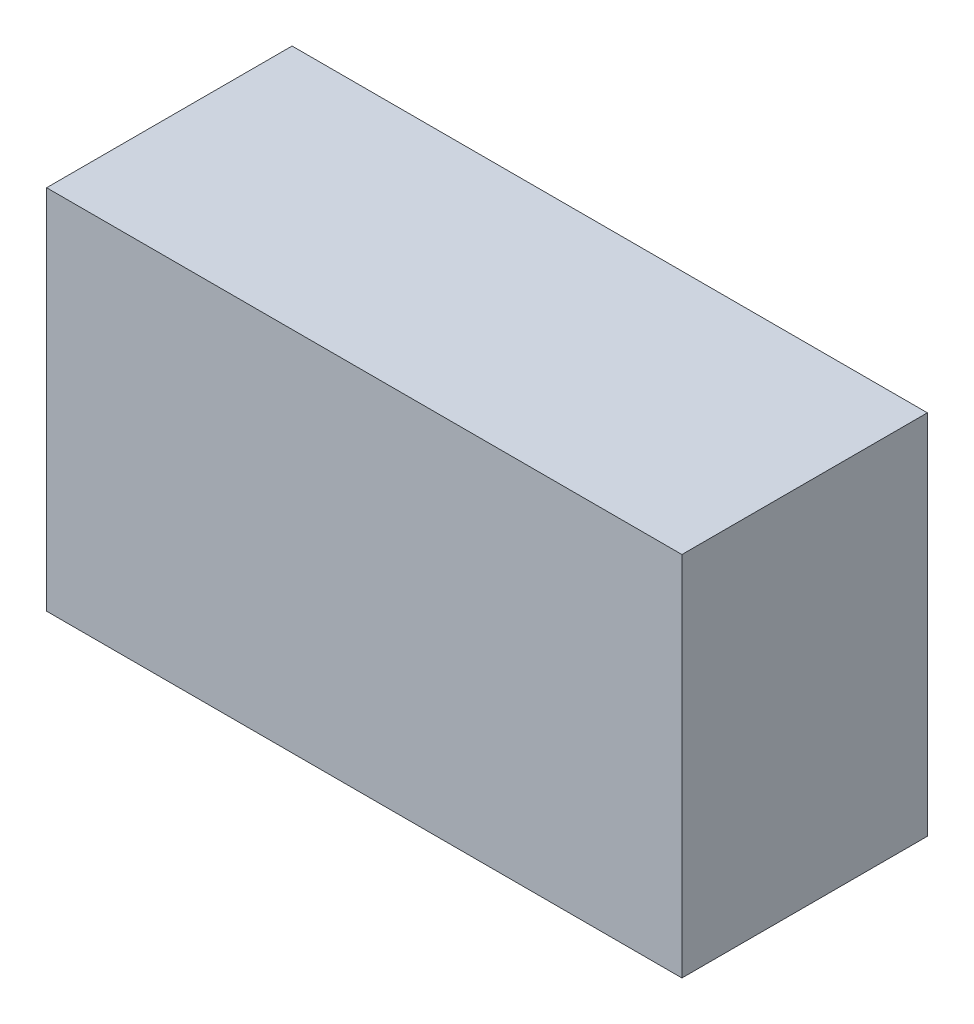
ISO-10303-21;
HEADER;
FILE_DESCRIPTION(('STEP AP214'),'2;1');
FILE_NAME('part.step','',(''),(''),'','','');
FILE_SCHEMA(('AUTOMOTIVE_DESIGN { 1 0 10303 214 1 1 1 1 }'));
ENDSEC;
DATA;
#1=APPLICATION_CONTEXT('core data for automotive mechanical design processes');
#2=APPLICATION_PROTOCOL_DEFINITION('international standard','automotive_design',2000,#1);
#3=PRODUCT_CONTEXT('',#1,'mechanical');
#4=PRODUCT('Part','Part','',(#3));
#5=PRODUCT_RELATED_PRODUCT_CATEGORY('part','',(#4));
#6=PRODUCT_DEFINITION_FORMATION('','',#4);
#7=PRODUCT_DEFINITION_CONTEXT('part definition',#1,'design');
#8=PRODUCT_DEFINITION('design','',#6,#7);
#9=PRODUCT_DEFINITION_SHAPE('','',#8);
#10=(LENGTH_UNIT() NAMED_UNIT(*) SI_UNIT(.MILLI.,.METRE.));
#11=(NAMED_UNIT(*) PLANE_ANGLE_UNIT() SI_UNIT($,.RADIAN.));
#12=(NAMED_UNIT(*) SI_UNIT($,.STERADIAN.) SOLID_ANGLE_UNIT());
#13=UNCERTAINTY_MEASURE_WITH_UNIT(LENGTH_MEASURE(1.E-05),#10,'distance_accuracy_value','');
#14=(GEOMETRIC_REPRESENTATION_CONTEXT(3) GLOBAL_UNCERTAINTY_ASSIGNED_CONTEXT((#13)) GLOBAL_UNIT_ASSIGNED_CONTEXT((#10,
#11,#12)) REPRESENTATION_CONTEXT('',''));
#15=CARTESIAN_POINT('',(0.,0.,0.));
#16=DIRECTION('',(0.,0.,1.));
#17=DIRECTION('',(1.,0.,0.));
#18=AXIS2_PLACEMENT_3D('',#15,#16,#17);
#19=CARTESIAN_POINT('',(-1.10000034,0.635,0.85000084));
#20=DIRECTION('',(0.,0.,-1.));
#21=DIRECTION('',(-1.,0.,0.));
#22=AXIS2_PLACEMENT_3D('',#19,#20,#21);
#23=PLANE('',#22);
#24=DIRECTION('',(1.,0.,0.));
#25=VECTOR('',#24,1.);
#26=CARTESIAN_POINT('',(-1.10000034,-0.635,0.85000084));
#27=LINE('',#26,#25);
#28=CARTESIAN_POINT('',(-1.10000034,-0.635,0.85000084));
#29=VERTEX_POINT('',#28);
#30=CARTESIAN_POINT('',(1.10000034,-0.635,0.85000084));
#31=VERTEX_POINT('',#30);
#32=EDGE_CURVE('E55',#29,#31,#27,.T.);
#33=ORIENTED_EDGE('',*,*,#32,.T.);
#34=DIRECTION('',(0.,1.,0.));
#35=VECTOR('',#34,1.);
#36=CARTESIAN_POINT('',(1.10000034,-0.635,0.85000084));
#37=LINE('',#36,#35);
#38=CARTESIAN_POINT('',(1.10000034,0.635,0.85000084));
#39=VERTEX_POINT('',#38);
#40=EDGE_CURVE('E58',#31,#39,#37,.T.);
#41=ORIENTED_EDGE('',*,*,#40,.T.);
#42=DIRECTION('',(1.,0.,0.));
#43=VECTOR('',#42,1.);
#44=CARTESIAN_POINT('',(1.10000034,0.635,0.85000084));
#45=LINE('',#44,#43);
#46=CARTESIAN_POINT('',(-1.10000034,0.635,0.85000084));
#47=VERTEX_POINT('',#46);
#48=EDGE_CURVE('E60',#39,#47,#45,.F.);
#49=ORIENTED_EDGE('',*,*,#48,.T.);
#50=DIRECTION('',(0.,1.,0.));
#51=VECTOR('',#50,1.);
#52=CARTESIAN_POINT('',(-1.10000034,0.635,0.85000084));
#53=LINE('',#52,#51);
#54=EDGE_CURVE('E20',#29,#47,#53,.T.);
#55=ORIENTED_EDGE('',*,*,#54,.F.);
#56=EDGE_LOOP('',(#33,#41,#49,#55));
#57=FACE_BOUND('',#56,.T.);
#58=ADVANCED_FACE('F17',(#57),#23,.F.);
#59=CARTESIAN_POINT('',(1.10000034,0.635,0.));
#60=DIRECTION('',(0.,-1.,0.));
#61=DIRECTION('',(0.,0.,-1.));
#62=AXIS2_PLACEMENT_3D('',#59,#60,#61);
#63=PLANE('',#62);
#64=DIRECTION('',(0.,0.,-1.));
#65=VECTOR('',#64,1.);
#66=CARTESIAN_POINT('',(-1.10000034,0.635,0.));
#67=LINE('',#66,#65);
#68=CARTESIAN_POINT('',(-1.10000034,0.635,0.));
#69=VERTEX_POINT('',#68);
#70=EDGE_CURVE('E71',#69,#47,#67,.F.);
#71=ORIENTED_EDGE('',*,*,#70,.T.);
#72=ORIENTED_EDGE('',*,*,#48,.F.);
#73=DIRECTION('',(0.,0.,1.));
#74=VECTOR('',#73,1.);
#75=CARTESIAN_POINT('',(1.10000034,0.635,0.));
#76=LINE('',#75,#74);
#77=CARTESIAN_POINT('',(1.10000034,0.635,0.));
#78=VERTEX_POINT('',#77);
#79=EDGE_CURVE('E65',#39,#78,#76,.F.);
#80=ORIENTED_EDGE('',*,*,#79,.T.);
#81=DIRECTION('',(-1.,0.,0.));
#82=VECTOR('',#81,1.);
#83=CARTESIAN_POINT('',(-1.10000034,0.635,0.));
#84=LINE('',#83,#82);
#85=EDGE_CURVE('E83',#69,#78,#84,.F.);
#86=ORIENTED_EDGE('',*,*,#85,.F.);
#87=EDGE_LOOP('',(#71,#72,#80,#86));
#88=FACE_BOUND('',#87,.T.);
#89=ADVANCED_FACE('F68',(#88),#63,.F.);
#90=CARTESIAN_POINT('',(1.10000034,-0.635,0.));
#91=DIRECTION('',(-1.,0.,0.));
#92=DIRECTION('',(0.,0.,1.));
#93=AXIS2_PLACEMENT_3D('',#90,#91,#92);
#94=PLANE('',#93);
#95=ORIENTED_EDGE('',*,*,#79,.F.);
#96=ORIENTED_EDGE('',*,*,#40,.F.);
#97=DIRECTION('',(0.,0.,1.));
#98=VECTOR('',#97,1.);
#99=CARTESIAN_POINT('',(1.10000034,-0.635,0.));
#100=LINE('',#99,#98);
#101=CARTESIAN_POINT('',(1.10000034,-0.635,0.));
#102=VERTEX_POINT('',#101);
#103=EDGE_CURVE('E77',#31,#102,#100,.F.);
#104=ORIENTED_EDGE('',*,*,#103,.T.);
#105=DIRECTION('',(0.,1.,0.));
#106=VECTOR('',#105,1.);
#107=CARTESIAN_POINT('',(1.10000034,0.635,0.));
#108=LINE('',#107,#106);
#109=EDGE_CURVE('E74',#78,#102,#108,.F.);
#110=ORIENTED_EDGE('',*,*,#109,.F.);
#111=EDGE_LOOP('',(#95,#96,#104,#110));
#112=FACE_BOUND('',#111,.T.);
#113=ADVANCED_FACE('F72',(#112),#94,.F.);
#114=CARTESIAN_POINT('',(-1.10000034,-0.635,0.));
#115=DIRECTION('',(0.,1.,0.));
#116=DIRECTION('',(0.,0.,1.));
#117=AXIS2_PLACEMENT_3D('',#114,#115,#116);
#118=PLANE('',#117);
#119=ORIENTED_EDGE('',*,*,#103,.F.);
#120=ORIENTED_EDGE('',*,*,#32,.F.);
#121=DIRECTION('',(0.,0.,-1.));
#122=VECTOR('',#121,1.);
#123=CARTESIAN_POINT('',(-1.10000034,-0.635,0.));
#124=LINE('',#123,#122);
#125=CARTESIAN_POINT('',(-1.10000034,-0.635,0.));
#126=VERTEX_POINT('',#125);
#127=EDGE_CURVE('E35',#29,#126,#124,.T.);
#128=ORIENTED_EDGE('',*,*,#127,.T.);
#129=DIRECTION('',(-1.,0.,0.));
#130=VECTOR('',#129,1.);
#131=CARTESIAN_POINT('',(-1.10000034,-0.635,0.));
#132=LINE('',#131,#130);
#133=EDGE_CURVE('E26',#102,#126,#132,.T.);
#134=ORIENTED_EDGE('',*,*,#133,.F.);
#135=EDGE_LOOP('',(#119,#120,#128,#134));
#136=FACE_BOUND('',#135,.T.);
#137=ADVANCED_FACE('F89',(#136),#118,.F.);
#138=CARTESIAN_POINT('',(-1.10000034,0.635,0.));
#139=DIRECTION('',(1.,0.,0.));
#140=DIRECTION('',(0.,0.,-1.));
#141=AXIS2_PLACEMENT_3D('',#138,#139,#140);
#142=PLANE('',#141);
#143=ORIENTED_EDGE('',*,*,#127,.F.);
#144=ORIENTED_EDGE('',*,*,#54,.T.);
#145=ORIENTED_EDGE('',*,*,#70,.F.);
#146=DIRECTION('',(0.,1.,0.));
#147=VECTOR('',#146,1.);
#148=CARTESIAN_POINT('',(-1.10000034,0.635,0.));
#149=LINE('',#148,#147);
#150=EDGE_CURVE('E11',#126,#69,#149,.T.);
#151=ORIENTED_EDGE('',*,*,#150,.F.);
#152=EDGE_LOOP('',(#143,#144,#145,#151));
#153=FACE_BOUND('',#152,.T.);
#154=ADVANCED_FACE('F91',(#153),#142,.F.);
#155=CARTESIAN_POINT('',(-1.10000034,0.635,0.));
#156=DIRECTION('',(0.,0.,-1.));
#157=DIRECTION('',(-1.,0.,0.));
#158=AXIS2_PLACEMENT_3D('',#155,#156,#157);
#159=PLANE('',#158);
#160=ORIENTED_EDGE('',*,*,#133,.T.);
#161=ORIENTED_EDGE('',*,*,#150,.T.);
#162=ORIENTED_EDGE('',*,*,#85,.T.);
#163=ORIENTED_EDGE('',*,*,#109,.T.);
#164=EDGE_LOOP('',(#160,#161,#162,#163));
#165=FACE_BOUND('',#164,.T.);
#166=ADVANCED_FACE('F88',(#165),#159,.T.);
#167=CLOSED_SHELL('',(#58,#89,#113,#137,#154,#166));
#168=MANIFOLD_SOLID_BREP('B1',#167);
#169=ADVANCED_BREP_SHAPE_REPRESENTATION('',(#18,#168),#14);
#170=SHAPE_DEFINITION_REPRESENTATION(#9,#169);
ENDSEC;
END-ISO-10303-21;
